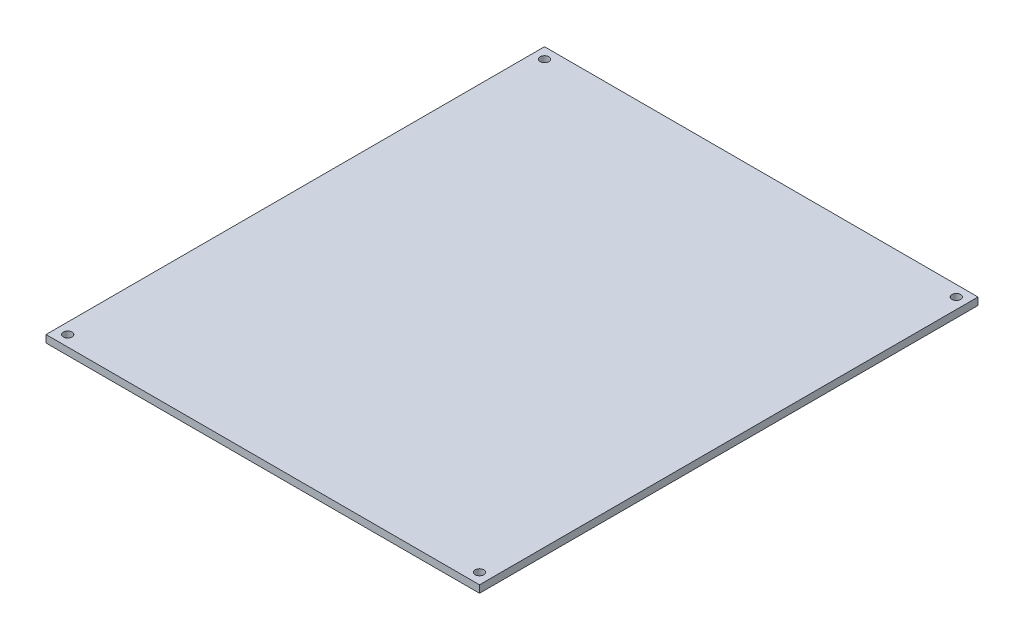
ISO-10303-21;
HEADER;
FILE_DESCRIPTION(('STEP AP214'),'2;1');
FILE_NAME('part.step','',(''),(''),'','','');
FILE_SCHEMA(('AUTOMOTIVE_DESIGN { 1 0 10303 214 1 1 1 1 }'));
ENDSEC;
DATA;
#1=APPLICATION_CONTEXT('core data for automotive mechanical design processes');
#2=APPLICATION_PROTOCOL_DEFINITION('international standard','automotive_design',2000,#1);
#3=PRODUCT_CONTEXT('',#1,'mechanical');
#4=PRODUCT('Part','Part','',(#3));
#5=PRODUCT_RELATED_PRODUCT_CATEGORY('part','',(#4));
#6=PRODUCT_DEFINITION_FORMATION('','',#4);
#7=PRODUCT_DEFINITION_CONTEXT('part definition',#1,'design');
#8=PRODUCT_DEFINITION('design','',#6,#7);
#9=PRODUCT_DEFINITION_SHAPE('','',#8);
#10=(LENGTH_UNIT() NAMED_UNIT(*) SI_UNIT(.MILLI.,.METRE.));
#11=(NAMED_UNIT(*) PLANE_ANGLE_UNIT() SI_UNIT($,.RADIAN.));
#12=(NAMED_UNIT(*) SI_UNIT($,.STERADIAN.) SOLID_ANGLE_UNIT());
#13=UNCERTAINTY_MEASURE_WITH_UNIT(LENGTH_MEASURE(1.E-05),#10,'distance_accuracy_value','');
#14=(GEOMETRIC_REPRESENTATION_CONTEXT(3) GLOBAL_UNCERTAINTY_ASSIGNED_CONTEXT((#13)) GLOBAL_UNIT_ASSIGNED_CONTEXT((#10,
#11,#12)) REPRESENTATION_CONTEXT('',''));
#15=CARTESIAN_POINT('',(0.,0.,0.));
#16=DIRECTION('',(0.,0.,1.));
#17=DIRECTION('',(1.,0.,0.));
#18=AXIS2_PLACEMENT_3D('',#15,#16,#17);
#19=CARTESIAN_POINT('',(50.,1.7,57.5));
#20=DIRECTION('',(-1.,0.,0.));
#21=DIRECTION('',(0.,0.,1.));
#22=AXIS2_PLACEMENT_3D('',#19,#20,#21);
#23=PLANE('',#22);
#24=DIRECTION('',(0.,0.,-1.));
#25=VECTOR('',#24,1.);
#26=CARTESIAN_POINT('',(50.,0.,57.5));
#27=LINE('',#26,#25);
#28=CARTESIAN_POINT('',(50.,0.,57.5));
#29=VERTEX_POINT('',#28);
#30=CARTESIAN_POINT('',(50.,0.,-57.5));
#31=VERTEX_POINT('',#30);
#32=EDGE_CURVE('E99',#29,#31,#27,.T.);
#33=ORIENTED_EDGE('',*,*,#32,.T.);
#34=DIRECTION('',(0.,-1.,0.));
#35=VECTOR('',#34,1.);
#36=CARTESIAN_POINT('',(50.,1.7,-57.5));
#37=LINE('',#36,#35);
#38=CARTESIAN_POINT('',(50.,1.7,-57.5));
#39=VERTEX_POINT('',#38);
#40=EDGE_CURVE('E11',#39,#31,#37,.T.);
#41=ORIENTED_EDGE('',*,*,#40,.F.);
#42=DIRECTION('',(0.,0.,-1.));
#43=VECTOR('',#42,1.);
#44=CARTESIAN_POINT('',(50.,1.7,57.5));
#45=LINE('',#44,#43);
#46=CARTESIAN_POINT('',(50.,1.7,57.5));
#47=VERTEX_POINT('',#46);
#48=EDGE_CURVE('E87',#47,#39,#45,.T.);
#49=ORIENTED_EDGE('',*,*,#48,.F.);
#50=DIRECTION('',(0.,-1.,0.));
#51=VECTOR('',#50,1.);
#52=CARTESIAN_POINT('',(50.,1.7,57.5));
#53=LINE('',#52,#51);
#54=EDGE_CURVE('E95',#47,#29,#53,.T.);
#55=ORIENTED_EDGE('',*,*,#54,.T.);
#56=EDGE_LOOP('',(#33,#41,#49,#55));
#57=FACE_BOUND('',#56,.T.);
#58=ADVANCED_FACE('F36',(#57),#23,.F.);
#59=CARTESIAN_POINT('',(-50.,1.7,-57.5));
#60=DIRECTION('',(0.,0.,1.));
#61=DIRECTION('',(1.,0.,0.));
#62=AXIS2_PLACEMENT_3D('',#59,#60,#61);
#63=PLANE('',#62);
#64=DIRECTION('',(-1.,0.,0.));
#65=VECTOR('',#64,1.);
#66=CARTESIAN_POINT('',(-50.,0.,-57.5));
#67=LINE('',#66,#65);
#68=CARTESIAN_POINT('',(-50.,0.,-57.5));
#69=VERTEX_POINT('',#68);
#70=EDGE_CURVE('E91',#31,#69,#67,.T.);
#71=ORIENTED_EDGE('',*,*,#70,.T.);
#72=DIRECTION('',(0.,-1.,0.));
#73=VECTOR('',#72,1.);
#74=CARTESIAN_POINT('',(-50.,1.7,-57.5));
#75=LINE('',#74,#73);
#76=CARTESIAN_POINT('',(-50.,1.7,-57.5));
#77=VERTEX_POINT('',#76);
#78=EDGE_CURVE('E44',#77,#69,#75,.T.);
#79=ORIENTED_EDGE('',*,*,#78,.F.);
#80=DIRECTION('',(-1.,0.,0.));
#81=VECTOR('',#80,1.);
#82=CARTESIAN_POINT('',(-50.,1.7,-57.5));
#83=LINE('',#82,#81);
#84=EDGE_CURVE('E82',#39,#77,#83,.T.);
#85=ORIENTED_EDGE('',*,*,#84,.F.);
#86=ORIENTED_EDGE('',*,*,#40,.T.);
#87=EDGE_LOOP('',(#71,#79,#85,#86));
#88=FACE_BOUND('',#87,.T.);
#89=ADVANCED_FACE('F90',(#88),#63,.F.);
#90=CARTESIAN_POINT('',(-50.,1.7,57.5));
#91=DIRECTION('',(1.,0.,0.));
#92=DIRECTION('',(0.,0.,-1.));
#93=AXIS2_PLACEMENT_3D('',#90,#91,#92);
#94=PLANE('',#93);
#95=DIRECTION('',(0.,0.,1.));
#96=VECTOR('',#95,1.);
#97=CARTESIAN_POINT('',(-50.,0.,57.5));
#98=LINE('',#97,#96);
#99=CARTESIAN_POINT('',(-50.,0.,57.5));
#100=VERTEX_POINT('',#99);
#101=EDGE_CURVE('E69',#69,#100,#98,.T.);
#102=ORIENTED_EDGE('',*,*,#101,.T.);
#103=DIRECTION('',(0.,-1.,0.));
#104=VECTOR('',#103,1.);
#105=CARTESIAN_POINT('',(-50.,1.7,57.5));
#106=LINE('',#105,#104);
#107=CARTESIAN_POINT('',(-50.,1.7,57.5));
#108=VERTEX_POINT('',#107);
#109=EDGE_CURVE('E92',#108,#100,#106,.T.);
#110=ORIENTED_EDGE('',*,*,#109,.F.);
#111=DIRECTION('',(0.,0.,1.));
#112=VECTOR('',#111,1.);
#113=CARTESIAN_POINT('',(-50.,1.7,57.5));
#114=LINE('',#113,#112);
#115=EDGE_CURVE('E85',#77,#108,#114,.T.);
#116=ORIENTED_EDGE('',*,*,#115,.F.);
#117=ORIENTED_EDGE('',*,*,#78,.T.);
#118=EDGE_LOOP('',(#102,#110,#116,#117));
#119=FACE_BOUND('',#118,.T.);
#120=ADVANCED_FACE('F93',(#119),#94,.F.);
#121=CARTESIAN_POINT('',(-50.,1.7,57.5));
#122=DIRECTION('',(0.,0.,-1.));
#123=DIRECTION('',(-1.,0.,0.));
#124=AXIS2_PLACEMENT_3D('',#121,#122,#123);
#125=PLANE('',#124);
#126=DIRECTION('',(1.,0.,0.));
#127=VECTOR('',#126,1.);
#128=CARTESIAN_POINT('',(-50.,0.,57.5));
#129=LINE('',#128,#127);
#130=EDGE_CURVE('E75',#100,#29,#129,.T.);
#131=ORIENTED_EDGE('',*,*,#130,.T.);
#132=ORIENTED_EDGE('',*,*,#54,.F.);
#133=DIRECTION('',(1.,0.,0.));
#134=VECTOR('',#133,1.);
#135=CARTESIAN_POINT('',(-50.,1.7,57.5));
#136=LINE('',#135,#134);
#137=EDGE_CURVE('E52',#108,#47,#136,.T.);
#138=ORIENTED_EDGE('',*,*,#137,.F.);
#139=ORIENTED_EDGE('',*,*,#109,.T.);
#140=EDGE_LOOP('',(#131,#132,#138,#139));
#141=FACE_BOUND('',#140,.T.);
#142=ADVANCED_FACE('F107',(#141),#125,.F.);
#143=CARTESIAN_POINT('',(0.,1.7,0.));
#144=DIRECTION('',(0.,-1.,0.));
#145=DIRECTION('',(0.,0.,-1.));
#146=AXIS2_PLACEMENT_3D('',#143,#144,#145);
#147=PLANE('',#146);
#148=CARTESIAN_POINT('',(47.5,1.7,-55.));
#149=DIRECTION('',(0.,-1.,0.));
#150=DIRECTION('',(0.,0.,-1.));
#151=AXIS2_PLACEMENT_3D('',#148,#149,#150);
#152=CIRCLE('',#151,0.999999999999998);
#153=CARTESIAN_POINT('',(47.5,1.7,-56.));
#154=VERTEX_POINT('',#153);
#155=EDGE_CURVE('E130',#154,#154,#152,.T.);
#156=ORIENTED_EDGE('',*,*,#155,.T.);
#157=EDGE_LOOP('',(#156));
#158=FACE_BOUND('',#157,.T.);
#159=CARTESIAN_POINT('',(-47.5,1.7,-55.));
#160=DIRECTION('',(0.,-1.,0.));
#161=DIRECTION('',(0.,0.,-1.));
#162=AXIS2_PLACEMENT_3D('',#159,#160,#161);
#163=CIRCLE('',#162,0.999999999999998);
#164=CARTESIAN_POINT('',(-47.5,1.7,-56.));
#165=VERTEX_POINT('',#164);
#166=EDGE_CURVE('E124',#165,#165,#163,.T.);
#167=ORIENTED_EDGE('',*,*,#166,.T.);
#168=EDGE_LOOP('',(#167));
#169=FACE_BOUND('',#168,.T.);
#170=CARTESIAN_POINT('',(-47.5,1.7,55.));
#171=DIRECTION('',(0.,-1.,0.));
#172=DIRECTION('',(0.,0.,-1.));
#173=AXIS2_PLACEMENT_3D('',#170,#171,#172);
#174=CIRCLE('',#173,0.999999999999998);
#175=CARTESIAN_POINT('',(-47.5,1.7,54.));
#176=VERTEX_POINT('',#175);
#177=EDGE_CURVE('E118',#176,#176,#174,.T.);
#178=ORIENTED_EDGE('',*,*,#177,.T.);
#179=EDGE_LOOP('',(#178));
#180=FACE_BOUND('',#179,.T.);
#181=CARTESIAN_POINT('',(47.5,1.7,55.));
#182=DIRECTION('',(0.,-1.,0.));
#183=DIRECTION('',(0.,0.,-1.));
#184=AXIS2_PLACEMENT_3D('',#181,#182,#183);
#185=CIRCLE('',#184,0.999999999999998);
#186=CARTESIAN_POINT('',(47.5,1.7,54.));
#187=VERTEX_POINT('',#186);
#188=EDGE_CURVE('E102',#187,#187,#185,.T.);
#189=ORIENTED_EDGE('',*,*,#188,.T.);
#190=EDGE_LOOP('',(#189));
#191=FACE_BOUND('',#190,.T.);
#192=ORIENTED_EDGE('',*,*,#48,.T.);
#193=ORIENTED_EDGE('',*,*,#84,.T.);
#194=ORIENTED_EDGE('',*,*,#115,.T.);
#195=ORIENTED_EDGE('',*,*,#137,.T.);
#196=EDGE_LOOP('',(#192,#193,#194,#195));
#197=FACE_BOUND('',#196,.T.);
#198=ADVANCED_FACE('F83',(#158,#169,#180,#191,#197),#147,.F.);
#199=CARTESIAN_POINT('',(0.,0.,0.));
#200=DIRECTION('',(0.,-1.,0.));
#201=DIRECTION('',(0.,0.,-1.));
#202=AXIS2_PLACEMENT_3D('',#199,#200,#201);
#203=PLANE('',#202);
#204=CARTESIAN_POINT('',(47.5,0.,-55.));
#205=DIRECTION('',(0.,-1.,0.));
#206=DIRECTION('',(0.,0.,-1.));
#207=AXIS2_PLACEMENT_3D('',#204,#205,#206);
#208=CIRCLE('',#207,0.999999999999998);
#209=CARTESIAN_POINT('',(47.5,0.,-56.));
#210=VERTEX_POINT('',#209);
#211=EDGE_CURVE('E133',#210,#210,#208,.T.);
#212=ORIENTED_EDGE('',*,*,#211,.F.);
#213=EDGE_LOOP('',(#212));
#214=FACE_BOUND('',#213,.T.);
#215=CARTESIAN_POINT('',(-47.5,0.,-55.));
#216=DIRECTION('',(0.,-1.,0.));
#217=DIRECTION('',(0.,0.,-1.));
#218=AXIS2_PLACEMENT_3D('',#215,#216,#217);
#219=CIRCLE('',#218,0.999999999999998);
#220=CARTESIAN_POINT('',(-47.5,0.,-56.));
#221=VERTEX_POINT('',#220);
#222=EDGE_CURVE('E127',#221,#221,#219,.T.);
#223=ORIENTED_EDGE('',*,*,#222,.F.);
#224=EDGE_LOOP('',(#223));
#225=FACE_BOUND('',#224,.T.);
#226=CARTESIAN_POINT('',(-47.5,0.,55.));
#227=DIRECTION('',(0.,-1.,0.));
#228=DIRECTION('',(0.,0.,-1.));
#229=AXIS2_PLACEMENT_3D('',#226,#227,#228);
#230=CIRCLE('',#229,0.999999999999998);
#231=CARTESIAN_POINT('',(-47.5,0.,54.));
#232=VERTEX_POINT('',#231);
#233=EDGE_CURVE('E121',#232,#232,#230,.T.);
#234=ORIENTED_EDGE('',*,*,#233,.F.);
#235=EDGE_LOOP('',(#234));
#236=FACE_BOUND('',#235,.T.);
#237=CARTESIAN_POINT('',(47.5,0.,55.));
#238=DIRECTION('',(0.,-1.,0.));
#239=DIRECTION('',(0.,0.,-1.));
#240=AXIS2_PLACEMENT_3D('',#237,#238,#239);
#241=CIRCLE('',#240,0.999999999999998);
#242=CARTESIAN_POINT('',(47.5,0.,54.));
#243=VERTEX_POINT('',#242);
#244=EDGE_CURVE('E115',#243,#243,#241,.T.);
#245=ORIENTED_EDGE('',*,*,#244,.F.);
#246=EDGE_LOOP('',(#245));
#247=FACE_BOUND('',#246,.T.);
#248=ORIENTED_EDGE('',*,*,#32,.F.);
#249=ORIENTED_EDGE('',*,*,#130,.F.);
#250=ORIENTED_EDGE('',*,*,#101,.F.);
#251=ORIENTED_EDGE('',*,*,#70,.F.);
#252=EDGE_LOOP('',(#248,#249,#250,#251));
#253=FACE_BOUND('',#252,.T.);
#254=ADVANCED_FACE('F110',(#214,#225,#236,#247,#253),#203,.T.);
#255=CARTESIAN_POINT('',(47.5,21.7,55.));
#256=DIRECTION('',(0.,-1.,0.));
#257=DIRECTION('',(0.,0.,-1.));
#258=AXIS2_PLACEMENT_3D('',#255,#256,#257);
#259=CYLINDRICAL_SURFACE('',#258,0.999999999999998);
#260=ORIENTED_EDGE('',*,*,#244,.T.);
#261=EDGE_LOOP('',(#260));
#262=FACE_BOUND('',#261,.T.);
#263=ORIENTED_EDGE('',*,*,#188,.F.);
#264=EDGE_LOOP('',(#263));
#265=FACE_BOUND('',#264,.T.);
#266=ADVANCED_FACE('F142',(#262,#265),#259,.F.);
#267=CARTESIAN_POINT('',(-47.5,21.7,55.));
#268=DIRECTION('',(0.,-1.,0.));
#269=DIRECTION('',(0.,0.,-1.));
#270=AXIS2_PLACEMENT_3D('',#267,#268,#269);
#271=CYLINDRICAL_SURFACE('',#270,0.999999999999998);
#272=ORIENTED_EDGE('',*,*,#233,.T.);
#273=EDGE_LOOP('',(#272));
#274=FACE_BOUND('',#273,.T.);
#275=ORIENTED_EDGE('',*,*,#177,.F.);
#276=EDGE_LOOP('',(#275));
#277=FACE_BOUND('',#276,.T.);
#278=ADVANCED_FACE('F152',(#274,#277),#271,.F.);
#279=CARTESIAN_POINT('',(-47.5,21.7,-55.));
#280=DIRECTION('',(0.,-1.,0.));
#281=DIRECTION('',(0.,0.,-1.));
#282=AXIS2_PLACEMENT_3D('',#279,#280,#281);
#283=CYLINDRICAL_SURFACE('',#282,0.999999999999998);
#284=ORIENTED_EDGE('',*,*,#222,.T.);
#285=EDGE_LOOP('',(#284));
#286=FACE_BOUND('',#285,.T.);
#287=ORIENTED_EDGE('',*,*,#166,.F.);
#288=EDGE_LOOP('',(#287));
#289=FACE_BOUND('',#288,.T.);
#290=ADVANCED_FACE('F203',(#286,#289),#283,.F.);
#291=CARTESIAN_POINT('',(47.5,21.7,-55.));
#292=DIRECTION('',(0.,-1.,0.));
#293=DIRECTION('',(0.,0.,-1.));
#294=AXIS2_PLACEMENT_3D('',#291,#292,#293);
#295=CYLINDRICAL_SURFACE('',#294,0.999999999999998);
#296=ORIENTED_EDGE('',*,*,#211,.T.);
#297=EDGE_LOOP('',(#296));
#298=FACE_BOUND('',#297,.T.);
#299=ORIENTED_EDGE('',*,*,#155,.F.);
#300=EDGE_LOOP('',(#299));
#301=FACE_BOUND('',#300,.T.);
#302=ADVANCED_FACE('F137',(#298,#301),#295,.F.);
#303=CLOSED_SHELL('',(#58,#89,#120,#142,#198,#254,#266,#278,#290,#302));
#304=MANIFOLD_SOLID_BREP('B2',#303);
#305=ADVANCED_BREP_SHAPE_REPRESENTATION('',(#18,#304),#14);
#306=SHAPE_DEFINITION_REPRESENTATION(#9,#305);
ENDSEC;
END-ISO-10303-21;
